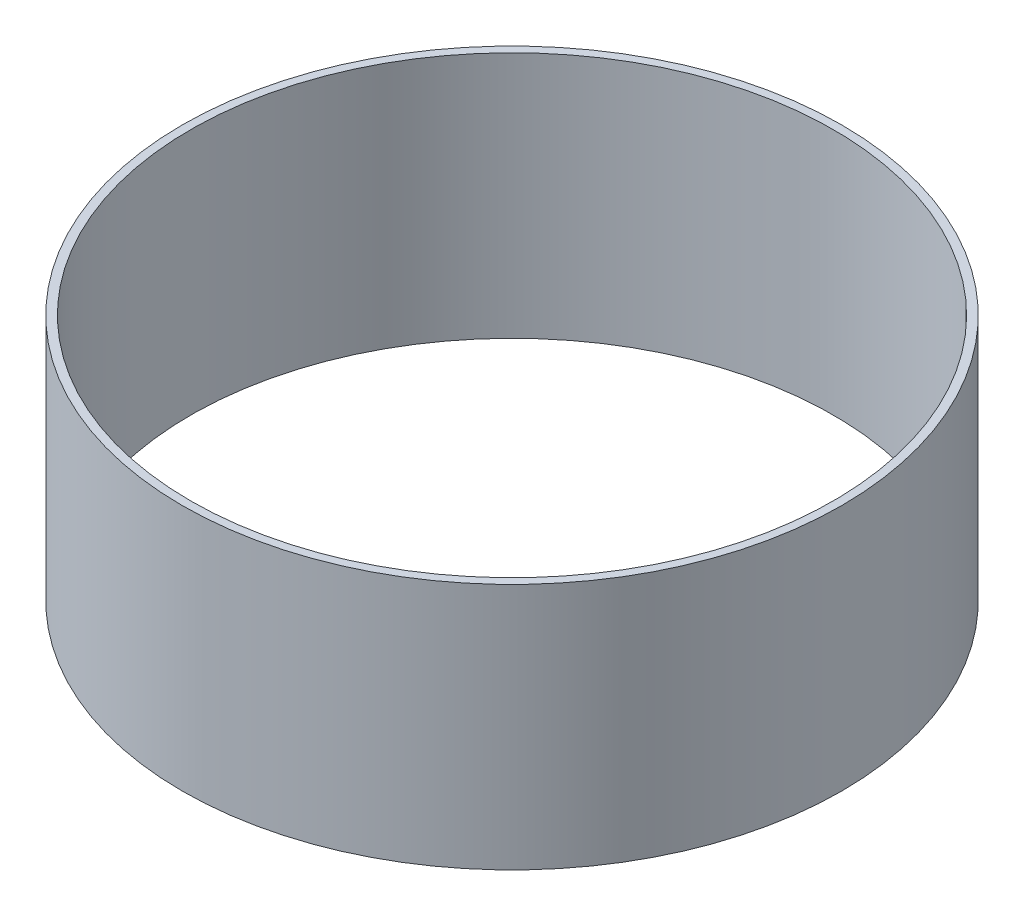
ISO-10303-21;
HEADER;
FILE_DESCRIPTION(('STEP AP214'),'2;1');
FILE_NAME('part.step','',(''),(''),'','','');
FILE_SCHEMA(('AUTOMOTIVE_DESIGN { 1 0 10303 214 1 1 1 1 }'));
ENDSEC;
DATA;
#1=APPLICATION_CONTEXT('core data for automotive mechanical design processes');
#2=APPLICATION_PROTOCOL_DEFINITION('international standard','automotive_design',2000,#1);
#3=PRODUCT_CONTEXT('',#1,'mechanical');
#4=PRODUCT('Part','Part','',(#3));
#5=PRODUCT_RELATED_PRODUCT_CATEGORY('part','',(#4));
#6=PRODUCT_DEFINITION_FORMATION('','',#4);
#7=PRODUCT_DEFINITION_CONTEXT('part definition',#1,'design');
#8=PRODUCT_DEFINITION('design','',#6,#7);
#9=PRODUCT_DEFINITION_SHAPE('','',#8);
#10=(LENGTH_UNIT() NAMED_UNIT(*) SI_UNIT(.MILLI.,.METRE.));
#11=(NAMED_UNIT(*) PLANE_ANGLE_UNIT() SI_UNIT($,.RADIAN.));
#12=(NAMED_UNIT(*) SI_UNIT($,.STERADIAN.) SOLID_ANGLE_UNIT());
#13=UNCERTAINTY_MEASURE_WITH_UNIT(LENGTH_MEASURE(1.E-05),#10,'distance_accuracy_value','');
#14=(GEOMETRIC_REPRESENTATION_CONTEXT(3) GLOBAL_UNCERTAINTY_ASSIGNED_CONTEXT((#13)) GLOBAL_UNIT_ASSIGNED_CONTEXT((#10,
#11,#12)) REPRESENTATION_CONTEXT('',''));
#15=CARTESIAN_POINT('',(0.,0.,0.));
#16=DIRECTION('',(0.,0.,1.));
#17=DIRECTION('',(1.,0.,0.));
#18=AXIS2_PLACEMENT_3D('',#15,#16,#17);
#19=CARTESIAN_POINT('',(0.,300.,0.));
#20=DIRECTION('',(0.,1.,0.));
#21=DIRECTION('',(0.,0.,1.));
#22=AXIS2_PLACEMENT_3D('',#19,#20,#21);
#23=PLANE('',#22);
#24=CARTESIAN_POINT('',(0.,300.,0.));
#25=DIRECTION('',(0.,1.,0.));
#26=DIRECTION('',(0.,0.,1.));
#27=AXIS2_PLACEMENT_3D('',#24,#25,#26);
#28=CIRCLE('',#27,400.);
#29=CARTESIAN_POINT('',(0.,300.,400.));
#30=VERTEX_POINT('',#29);
#31=EDGE_CURVE('E10',#30,#30,#28,.T.);
#32=ORIENTED_EDGE('',*,*,#31,.T.);
#33=EDGE_LOOP('',(#32));
#34=FACE_BOUND('',#33,.T.);
#35=CARTESIAN_POINT('',(0.,300.,0.));
#36=DIRECTION('',(0.,1.,0.));
#37=DIRECTION('',(0.,0.,1.));
#38=AXIS2_PLACEMENT_3D('',#35,#36,#37);
#39=CIRCLE('',#38,390.);
#40=CARTESIAN_POINT('',(0.,300.,390.));
#41=VERTEX_POINT('',#40);
#42=EDGE_CURVE('E50',#41,#41,#39,.T.);
#43=ORIENTED_EDGE('',*,*,#42,.F.);
#44=EDGE_LOOP('',(#43));
#45=FACE_BOUND('',#44,.T.);
#46=ADVANCED_FACE('F39',(#34,#45),#23,.T.);
#47=CARTESIAN_POINT('',(0.,0.,0.));
#48=DIRECTION('',(0.,1.,0.));
#49=DIRECTION('',(0.,0.,1.));
#50=AXIS2_PLACEMENT_3D('',#47,#48,#49);
#51=PLANE('',#50);
#52=CARTESIAN_POINT('',(0.,0.,0.));
#53=DIRECTION('',(0.,1.,0.));
#54=DIRECTION('',(0.,0.,1.));
#55=AXIS2_PLACEMENT_3D('',#52,#53,#54);
#56=CIRCLE('',#55,400.);
#57=CARTESIAN_POINT('',(0.,0.,400.));
#58=VERTEX_POINT('',#57);
#59=EDGE_CURVE('E43',#58,#58,#56,.T.);
#60=ORIENTED_EDGE('',*,*,#59,.F.);
#61=EDGE_LOOP('',(#60));
#62=FACE_BOUND('',#61,.T.);
#63=CARTESIAN_POINT('',(0.,0.,0.));
#64=DIRECTION('',(0.,1.,0.));
#65=DIRECTION('',(0.,0.,1.));
#66=AXIS2_PLACEMENT_3D('',#63,#64,#65);
#67=CIRCLE('',#66,390.);
#68=CARTESIAN_POINT('',(0.,0.,390.));
#69=VERTEX_POINT('',#68);
#70=EDGE_CURVE('E52',#69,#69,#67,.T.);
#71=ORIENTED_EDGE('',*,*,#70,.T.);
#72=EDGE_LOOP('',(#71));
#73=FACE_BOUND('',#72,.T.);
#74=ADVANCED_FACE('F62',(#62,#73),#51,.F.);
#75=CARTESIAN_POINT('',(0.,300.,0.));
#76=DIRECTION('',(0.,-1.,0.));
#77=DIRECTION('',(0.,0.,-1.));
#78=AXIS2_PLACEMENT_3D('',#75,#76,#77);
#79=CYLINDRICAL_SURFACE('',#78,400.);
#80=ORIENTED_EDGE('',*,*,#31,.F.);
#81=EDGE_LOOP('',(#80));
#82=FACE_BOUND('',#81,.T.);
#83=ORIENTED_EDGE('',*,*,#59,.T.);
#84=EDGE_LOOP('',(#83));
#85=FACE_BOUND('',#84,.T.);
#86=ADVANCED_FACE('F41',(#82,#85),#79,.T.);
#87=CARTESIAN_POINT('',(0.,300.,0.));
#88=DIRECTION('',(0.,-1.,0.));
#89=DIRECTION('',(0.,0.,-1.));
#90=AXIS2_PLACEMENT_3D('',#87,#88,#89);
#91=CYLINDRICAL_SURFACE('',#90,390.);
#92=ORIENTED_EDGE('',*,*,#42,.T.);
#93=EDGE_LOOP('',(#92));
#94=FACE_BOUND('',#93,.T.);
#95=ORIENTED_EDGE('',*,*,#70,.F.);
#96=EDGE_LOOP('',(#95));
#97=FACE_BOUND('',#96,.T.);
#98=ADVANCED_FACE('F58',(#94,#97),#91,.F.);
#99=CLOSED_SHELL('',(#46,#74,#86,#98));
#100=MANIFOLD_SOLID_BREP('B2',#99);
#101=ADVANCED_BREP_SHAPE_REPRESENTATION('',(#18,#100),#14);
#102=SHAPE_DEFINITION_REPRESENTATION(#9,#101);
ENDSEC;
END-ISO-10303-21;
